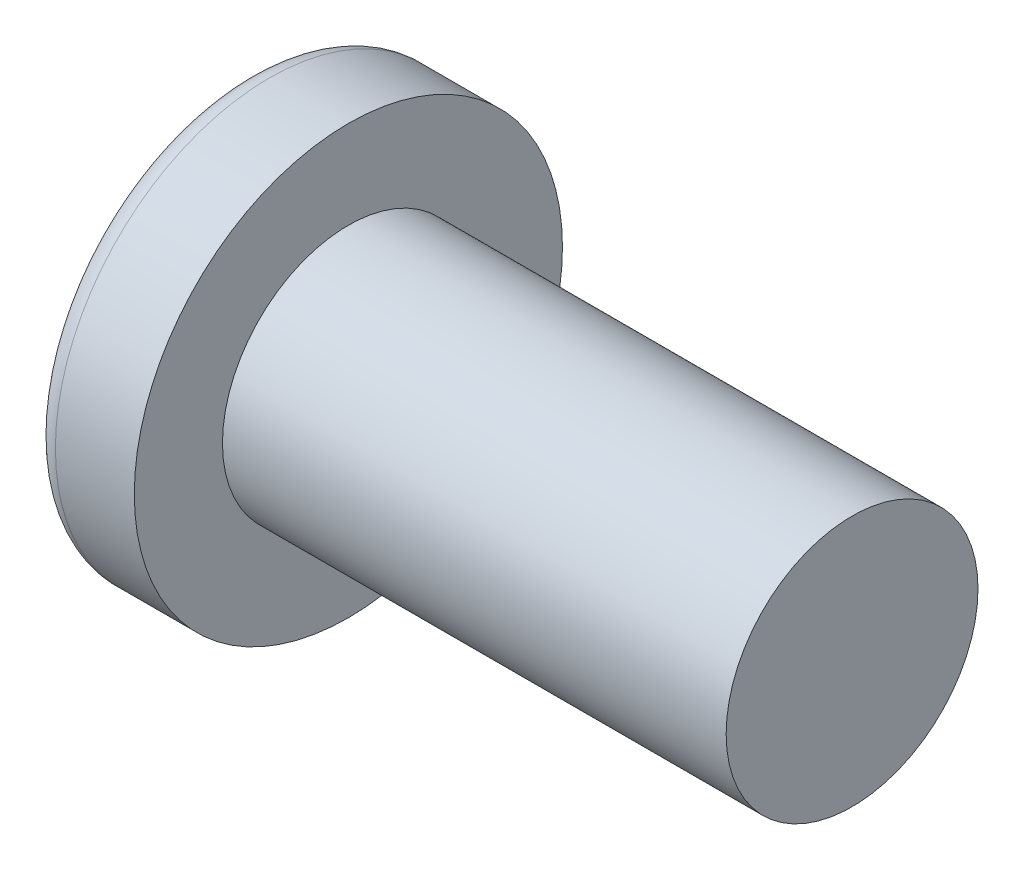
ISO-10303-21;
HEADER;
FILE_DESCRIPTION(('STEP AP214'),'2;1');
FILE_NAME('part.step','',(''),(''),'','','');
FILE_SCHEMA(('AUTOMOTIVE_DESIGN { 1 0 10303 214 1 1 1 1 }'));
ENDSEC;
DATA;
#1=APPLICATION_CONTEXT('core data for automotive mechanical design processes');
#2=APPLICATION_PROTOCOL_DEFINITION('international standard','automotive_design',2000,#1);
#3=PRODUCT_CONTEXT('',#1,'mechanical');
#4=PRODUCT('Part','Part','',(#3));
#5=PRODUCT_RELATED_PRODUCT_CATEGORY('part','',(#4));
#6=PRODUCT_DEFINITION_FORMATION('','',#4);
#7=PRODUCT_DEFINITION_CONTEXT('part definition',#1,'design');
#8=PRODUCT_DEFINITION('design','',#6,#7);
#9=PRODUCT_DEFINITION_SHAPE('','',#8);
#10=(LENGTH_UNIT() NAMED_UNIT(*) SI_UNIT(.MILLI.,.METRE.));
#11=(NAMED_UNIT(*) PLANE_ANGLE_UNIT() SI_UNIT($,.RADIAN.));
#12=(NAMED_UNIT(*) SI_UNIT($,.STERADIAN.) SOLID_ANGLE_UNIT());
#13=UNCERTAINTY_MEASURE_WITH_UNIT(LENGTH_MEASURE(1.E-05),#10,'distance_accuracy_value','');
#14=(GEOMETRIC_REPRESENTATION_CONTEXT(3) GLOBAL_UNCERTAINTY_ASSIGNED_CONTEXT((#13)) GLOBAL_UNIT_ASSIGNED_CONTEXT((#10,
#11,#12)) REPRESENTATION_CONTEXT('',''));
#15=CARTESIAN_POINT('',(0.,0.,0.));
#16=DIRECTION('',(0.,0.,1.));
#17=DIRECTION('',(1.,0.,0.));
#18=AXIS2_PLACEMENT_3D('',#15,#16,#17);
#19=CARTESIAN_POINT('',(-3.28747787148539,0.,0.100715804572103));
#20=DIRECTION('',(0.,-1.,0.));
#21=DIRECTION('',(0.,0.,1.));
#22=AXIS2_PLACEMENT_3D('',#19,#20,#21);
#23=CIRCLE('',#22,4.51364593578458);
#24=TRIMMED_CURVE('',#23,(PARAMETER_VALUE(-1.59311180425498)),
(PARAMETER_VALUE(1.59311180425498)),.T.,.PARAMETER.);
#25=CARTESIAN_POINT('',(-3.28747787148539,0.,0.));
#26=DIRECTION('',(-1.,0.,0.));
#27=AXIS1_PLACEMENT('',#25,#26);
#28=SURFACE_OF_REVOLUTION('',#24,#27);
#29=CARTESIAN_POINT('',(-7.8,0.,0.));
#30=VERTEX_POINT('',#29);
#31=VERTEX_LOOP('',#30);
#32=FACE_BOUND('',#31,.T.);
#33=CARTESIAN_POINT('',(-7.20078153784551,0.,0.));
#34=DIRECTION('',(-1.,0.,0.));
#35=DIRECTION('',(0.,0.,1.));
#36=AXIS2_PLACEMENT_3D('',#33,#34,#35);
#37=CIRCLE('',#36,2.34994990721174);
#38=CARTESIAN_POINT('',(-7.20078153784551,0.,2.34994990721174));
#39=VERTEX_POINT('',#38);
#40=EDGE_CURVE('E47',#39,#39,#37,.T.);
#41=ORIENTED_EDGE('',*,*,#40,.T.);
#42=EDGE_LOOP('',(#41));
#43=FACE_BOUND('',#42,.T.);
#44=ADVANCED_FACE('F33',(#32,#43),#28,.T.);
#45=CARTESIAN_POINT('',(0.,0.,0.));
#46=DIRECTION('',(-1.,0.,0.));
#47=DIRECTION('',(0.,0.,1.));
#48=AXIS2_PLACEMENT_3D('',#45,#46,#47);
#49=PLANE('',#48);
#50=CARTESIAN_POINT('',(0.,0.,0.));
#51=DIRECTION('',(-1.,0.,0.));
#52=DIRECTION('',(0.,0.,1.));
#53=AXIS2_PLACEMENT_3D('',#50,#51,#52);
#54=CIRCLE('',#53,1.5);
#55=CARTESIAN_POINT('',(0.,0.,1.5));
#56=VERTEX_POINT('',#55);
#57=EDGE_CURVE('E11',#56,#56,#54,.T.);
#58=ORIENTED_EDGE('',*,*,#57,.F.);
#59=EDGE_LOOP('',(#58));
#60=FACE_BOUND('',#59,.T.);
#61=ADVANCED_FACE('F44',(#60),#49,.F.);
#62=CARTESIAN_POINT('',(-7.8,0.,0.));
#63=DIRECTION('',(-1.,0.,0.));
#64=DIRECTION('',(0.,0.,1.));
#65=AXIS2_PLACEMENT_3D('',#62,#63,#64);
#66=CYLINDRICAL_SURFACE('',#65,1.5);
#67=CARTESIAN_POINT('',(-6.,0.,0.));
#68=DIRECTION('',(-1.,0.,0.));
#69=DIRECTION('',(0.,0.,1.));
#70=AXIS2_PLACEMENT_3D('',#67,#68,#69);
#71=CIRCLE('',#70,1.5);
#72=CARTESIAN_POINT('',(-6.,0.,1.5));
#73=VERTEX_POINT('',#72);
#74=EDGE_CURVE('E39',#73,#73,#71,.T.);
#75=ORIENTED_EDGE('',*,*,#74,.F.);
#76=EDGE_LOOP('',(#75));
#77=FACE_BOUND('',#76,.T.);
#78=ORIENTED_EDGE('',*,*,#57,.T.);
#79=EDGE_LOOP('',(#78));
#80=FACE_BOUND('',#79,.T.);
#81=ADVANCED_FACE('F61',(#77,#80),#66,.T.);
#82=CARTESIAN_POINT('',(-6.,0.,-1.5));
#83=DIRECTION('',(-1.,0.,0.));
#84=DIRECTION('',(0.,0.,1.));
#85=AXIS2_PLACEMENT_3D('',#82,#83,#84);
#86=PLANE('',#85);
#87=CARTESIAN_POINT('',(-6.,0.,0.));
#88=DIRECTION('',(-1.,0.,0.));
#89=DIRECTION('',(0.,0.,1.));
#90=AXIS2_PLACEMENT_3D('',#87,#88,#89);
#91=CIRCLE('',#90,2.55);
#92=CARTESIAN_POINT('',(-6.,0.,2.55));
#93=VERTEX_POINT('',#92);
#94=EDGE_CURVE('E52',#93,#93,#91,.T.);
#95=ORIENTED_EDGE('',*,*,#94,.F.);
#96=EDGE_LOOP('',(#95));
#97=FACE_BOUND('',#96,.T.);
#98=ORIENTED_EDGE('',*,*,#74,.T.);
#99=EDGE_LOOP('',(#98));
#100=FACE_BOUND('',#99,.T.);
#101=ADVANCED_FACE('F59',(#97,#100),#86,.F.);
#102=CARTESIAN_POINT('',(-7.8,0.,0.));
#103=DIRECTION('',(-1.,0.,0.));
#104=DIRECTION('',(0.,0.,1.));
#105=AXIS2_PLACEMENT_3D('',#102,#103,#104);
#106=CYLINDRICAL_SURFACE('',#105,2.55);
#107=CARTESIAN_POINT('',(-6.94,0.,0.));
#108=DIRECTION('',(-1.,0.,0.));
#109=DIRECTION('',(0.,0.,1.));
#110=AXIS2_PLACEMENT_3D('',#107,#108,#109);
#111=CIRCLE('',#110,2.55);
#112=CARTESIAN_POINT('',(-6.94,0.,2.55));
#113=VERTEX_POINT('',#112);
#114=EDGE_CURVE('E49',#113,#113,#111,.T.);
#115=ORIENTED_EDGE('',*,*,#114,.F.);
#116=EDGE_LOOP('',(#115));
#117=FACE_BOUND('',#116,.T.);
#118=ORIENTED_EDGE('',*,*,#94,.T.);
#119=EDGE_LOOP('',(#118));
#120=FACE_BOUND('',#119,.T.);
#121=ADVANCED_FACE('F73',(#117,#120),#106,.T.);
#122=CARTESIAN_POINT('',(-6.94,0.,0.));
#123=DIRECTION('',(-1.,0.,0.));
#124=DIRECTION('',(0.,0.,1.));
#125=AXIS2_PLACEMENT_3D('',#122,#123,#124);
#126=TOROIDAL_SURFACE('',#125,2.28,0.269999999999998);
#127=ORIENTED_EDGE('',*,*,#40,.F.);
#128=EDGE_LOOP('',(#127));
#129=FACE_BOUND('',#128,.T.);
#130=ORIENTED_EDGE('',*,*,#114,.T.);
#131=EDGE_LOOP('',(#130));
#132=FACE_BOUND('',#131,.T.);
#133=ADVANCED_FACE('F77',(#129,#132),#126,.T.);
#134=CLOSED_SHELL('',(#44,#61,#81,#101,#121,#133));
#135=MANIFOLD_SOLID_BREP('B2',#134);
#136=ADVANCED_BREP_SHAPE_REPRESENTATION('',(#18,#135),#14);
#137=SHAPE_DEFINITION_REPRESENTATION(#9,#136);
ENDSEC;
END-ISO-10303-21;
